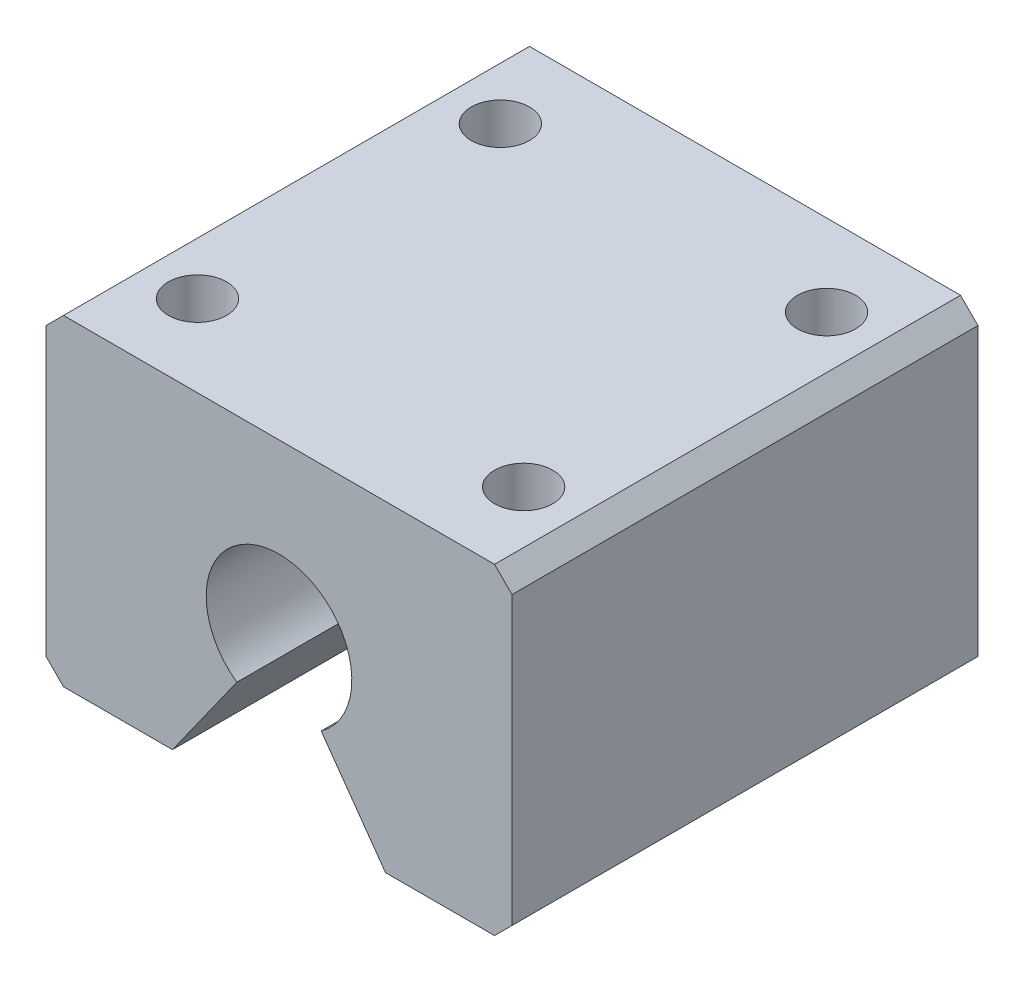
ISO-10303-21;
HEADER;
FILE_DESCRIPTION(('STEP AP214'),'2;1');
FILE_NAME('part.step','',(''),(''),'','','');
FILE_SCHEMA(('AUTOMOTIVE_DESIGN { 1 0 10303 214 1 1 1 1 }'));
ENDSEC;
DATA;
#1=APPLICATION_CONTEXT('core data for automotive mechanical design processes');
#2=APPLICATION_PROTOCOL_DEFINITION('international standard','automotive_design',2000,#1);
#3=PRODUCT_CONTEXT('',#1,'mechanical');
#4=PRODUCT('Part','Part','',(#3));
#5=PRODUCT_RELATED_PRODUCT_CATEGORY('part','',(#4));
#6=PRODUCT_DEFINITION_FORMATION('','',#4);
#7=PRODUCT_DEFINITION_CONTEXT('part definition',#1,'design');
#8=PRODUCT_DEFINITION('design','',#6,#7);
#9=PRODUCT_DEFINITION_SHAPE('','',#8);
#10=(LENGTH_UNIT() NAMED_UNIT(*) SI_UNIT(.MILLI.,.METRE.));
#11=(NAMED_UNIT(*) PLANE_ANGLE_UNIT() SI_UNIT($,.RADIAN.));
#12=(NAMED_UNIT(*) SI_UNIT($,.STERADIAN.) SOLID_ANGLE_UNIT());
#13=UNCERTAINTY_MEASURE_WITH_UNIT(LENGTH_MEASURE(1.E-05),#10,'distance_accuracy_value','');
#14=(GEOMETRIC_REPRESENTATION_CONTEXT(3) GLOBAL_UNCERTAINTY_ASSIGNED_CONTEXT((#13)) GLOBAL_UNIT_ASSIGNED_CONTEXT((#10,
#11,#12)) REPRESENTATION_CONTEXT('',''));
#15=CARTESIAN_POINT('',(0.,0.,0.));
#16=DIRECTION('',(0.,0.,1.));
#17=DIRECTION('',(1.,0.,0.));
#18=AXIS2_PLACEMENT_3D('',#15,#16,#17);
#19=CARTESIAN_POINT('',(0.,0.,0.));
#20=DIRECTION('',(0.,1.,0.));
#21=DIRECTION('',(0.,0.,1.));
#22=AXIS2_PLACEMENT_3D('',#19,#20,#21);
#23=PLANE('',#22);
#24=DIRECTION('',(-1.,0.,0.));
#25=VECTOR('',#24,1.);
#26=CARTESIAN_POINT('',(-20.,0.,-20.));
#27=LINE('',#26,#25);
#28=CARTESIAN_POINT('',(18.5,0.,-20.));
#29=VERTEX_POINT('',#28);
#30=CARTESIAN_POINT('',(9.14121829534251,0.,-20.));
#31=VERTEX_POINT('',#30);
#32=EDGE_CURVE('E196',#29,#31,#27,.T.);
#33=ORIENTED_EDGE('',*,*,#32,.F.);
#34=DIRECTION('',(0.,0.,1.));
#35=VECTOR('',#34,1.);
#36=CARTESIAN_POINT('',(18.5,0.,0.));
#37=LINE('',#36,#35);
#38=CARTESIAN_POINT('',(18.5,0.,20.));
#39=VERTEX_POINT('',#38);
#40=EDGE_CURVE('E234',#29,#39,#37,.T.);
#41=ORIENTED_EDGE('',*,*,#40,.T.);
#42=DIRECTION('',(1.,0.,0.));
#43=VECTOR('',#42,1.);
#44=CARTESIAN_POINT('',(-20.,0.,20.));
#45=LINE('',#44,#43);
#46=CARTESIAN_POINT('',(9.14121829534251,0.,20.));
#47=VERTEX_POINT('',#46);
#48=EDGE_CURVE('E199',#47,#39,#45,.T.);
#49=ORIENTED_EDGE('',*,*,#48,.F.);
#50=DIRECTION('',(0.,0.,1.));
#51=VECTOR('',#50,1.);
#52=CARTESIAN_POINT('',(9.14121829534251,0.,-20.));
#53=LINE('',#52,#51);
#54=EDGE_CURVE('E181',#31,#47,#53,.T.);
#55=ORIENTED_EDGE('',*,*,#54,.F.);
#56=EDGE_LOOP('',(#33,#41,#49,#55));
#57=FACE_BOUND('',#56,.T.);
#58=ADVANCED_FACE('F41',(#57),#23,.F.);
#59=CARTESIAN_POINT('',(20.,27.6,-20.));
#60=DIRECTION('',(-1.,0.,0.));
#61=DIRECTION('',(0.,0.,1.));
#62=AXIS2_PLACEMENT_3D('',#59,#60,#61);
#63=PLANE('',#62);
#64=DIRECTION('',(0.,-1.,0.));
#65=VECTOR('',#64,1.);
#66=CARTESIAN_POINT('',(20.,27.6,20.));
#67=LINE('',#66,#65);
#68=CARTESIAN_POINT('',(20.,26.1,20.));
#69=VERTEX_POINT('',#68);
#70=CARTESIAN_POINT('',(20.,1.50000000000002,20.));
#71=VERTEX_POINT('',#70);
#72=EDGE_CURVE('E195',#69,#71,#67,.T.);
#73=ORIENTED_EDGE('',*,*,#72,.T.);
#74=DIRECTION('',(0.,0.,-1.));
#75=VECTOR('',#74,1.);
#76=CARTESIAN_POINT('',(20.,1.50000000000002,-20.));
#77=LINE('',#76,#75);
#78=CARTESIAN_POINT('',(20.,1.50000000000002,-20.));
#79=VERTEX_POINT('',#78);
#80=EDGE_CURVE('E218',#71,#79,#77,.T.);
#81=ORIENTED_EDGE('',*,*,#80,.T.);
#82=DIRECTION('',(0.,-1.,0.));
#83=VECTOR('',#82,1.);
#84=CARTESIAN_POINT('',(20.,27.6,-20.));
#85=LINE('',#84,#83);
#86=CARTESIAN_POINT('',(20.,26.1,-20.));
#87=VERTEX_POINT('',#86);
#88=EDGE_CURVE('E212',#87,#79,#85,.T.);
#89=ORIENTED_EDGE('',*,*,#88,.F.);
#90=DIRECTION('',(0.,0.,1.));
#91=VECTOR('',#90,1.);
#92=CARTESIAN_POINT('',(20.,26.1,20.));
#93=LINE('',#92,#91);
#94=EDGE_CURVE('E215',#87,#69,#93,.T.);
#95=ORIENTED_EDGE('',*,*,#94,.T.);
#96=EDGE_LOOP('',(#73,#81,#89,#95));
#97=FACE_BOUND('',#96,.T.);
#98=ADVANCED_FACE('F294',(#97),#63,.F.);
#99=CARTESIAN_POINT('',(-20.,27.6,-20.));
#100=DIRECTION('',(0.,0.,1.));
#101=DIRECTION('',(1.,0.,0.));
#102=AXIS2_PLACEMENT_3D('',#99,#100,#101);
#103=PLANE('',#102);
#104=ORIENTED_EDGE('',*,*,#88,.T.);
#105=DIRECTION('',(0.707106781186547,0.707106781186547,0.));
#106=VECTOR('',#105,1.);
#107=CARTESIAN_POINT('',(20.,1.50000000000002,-20.));
#108=LINE('',#107,#106);
#109=EDGE_CURVE('E231',#79,#29,#108,.F.);
#110=ORIENTED_EDGE('',*,*,#109,.T.);
#111=ORIENTED_EDGE('',*,*,#32,.T.);
#112=DIRECTION('',(-0.579153157338015,0.815218756129549,0.));
#113=VECTOR('',#112,1.);
#114=CARTESIAN_POINT('',(9.14121829534251,0.,-20.));
#115=LINE('',#114,#113);
#116=CARTESIAN_POINT('',(3.61970723336259,7.7721053971147,-20.));
#117=VERTEX_POINT('',#116);
#118=EDGE_CURVE('E145',#31,#117,#115,.T.);
#119=ORIENTED_EDGE('',*,*,#118,.T.);
#120=CARTESIAN_POINT('',(0.,12.8672226229244,-20.));
#121=DIRECTION('',(0.,0.,1.));
#122=DIRECTION('',(1.,0.,0.));
#123=AXIS2_PLACEMENT_3D('',#120,#121,#122);
#124=CIRCLE('',#123,6.25);
#125=CARTESIAN_POINT('',(-3.61970723336259,7.7721053971147,-20.));
#126=VERTEX_POINT('',#125);
#127=EDGE_CURVE('E136',#117,#126,#124,.T.);
#128=ORIENTED_EDGE('',*,*,#127,.T.);
#129=DIRECTION('',(-0.579153157338015,-0.815218756129549,0.));
#130=VECTOR('',#129,1.);
#131=CARTESIAN_POINT('',(-9.14121829534251,0.,-20.));
#132=LINE('',#131,#130);
#133=CARTESIAN_POINT('',(-9.14121829534251,0.,-20.));
#134=VERTEX_POINT('',#133);
#135=EDGE_CURVE('E148',#126,#134,#132,.T.);
#136=ORIENTED_EDGE('',*,*,#135,.T.);
#137=CARTESIAN_POINT('',(-18.5,0.,-20.));
#138=VERTEX_POINT('',#137);
#139=EDGE_CURVE('E180',#134,#138,#27,.T.);
#140=ORIENTED_EDGE('',*,*,#139,.T.);
#141=DIRECTION('',(0.707106781186546,-0.707106781186549,0.));
#142=VECTOR('',#141,1.);
#143=CARTESIAN_POINT('',(-20.,1.50000000000002,-20.));
#144=LINE('',#143,#142);
#145=CARTESIAN_POINT('',(-20.,1.50000000000002,-20.));
#146=VERTEX_POINT('',#145);
#147=EDGE_CURVE('E228',#138,#146,#144,.F.);
#148=ORIENTED_EDGE('',*,*,#147,.T.);
#149=DIRECTION('',(0.,-1.,0.));
#150=VECTOR('',#149,1.);
#151=CARTESIAN_POINT('',(-20.,27.6,-20.));
#152=LINE('',#151,#150);
#153=CARTESIAN_POINT('',(-20.,26.1,-20.));
#154=VERTEX_POINT('',#153);
#155=EDGE_CURVE('E208',#154,#146,#152,.T.);
#156=ORIENTED_EDGE('',*,*,#155,.F.);
#157=DIRECTION('',(0.707106781186545,0.70710678118655,0.));
#158=VECTOR('',#157,1.);
#159=CARTESIAN_POINT('',(-18.5,27.6,-20.));
#160=LINE('',#159,#158);
#161=CARTESIAN_POINT('',(-18.5,27.6,-20.));
#162=VERTEX_POINT('',#161);
#163=EDGE_CURVE('E222',#154,#162,#160,.T.);
#164=ORIENTED_EDGE('',*,*,#163,.T.);
#165=DIRECTION('',(-1.,0.,0.));
#166=VECTOR('',#165,1.);
#167=CARTESIAN_POINT('',(-20.,27.6,-20.));
#168=LINE('',#167,#166);
#169=CARTESIAN_POINT('',(18.5,27.6,-20.));
#170=VERTEX_POINT('',#169);
#171=EDGE_CURVE('E186',#170,#162,#168,.T.);
#172=ORIENTED_EDGE('',*,*,#171,.F.);
#173=DIRECTION('',(0.707106781186546,-0.707106781186549,0.));
#174=VECTOR('',#173,1.);
#175=CARTESIAN_POINT('',(18.5,27.6,-20.));
#176=LINE('',#175,#174);
#177=EDGE_CURVE('E225',#170,#87,#176,.T.);
#178=ORIENTED_EDGE('',*,*,#177,.T.);
#179=EDGE_LOOP('',(#104,#110,#111,#119,#128,#136,#140,#148,#156,#164,#172,#178));
#180=FACE_BOUND('',#179,.T.);
#181=ADVANCED_FACE('F157',(#180),#103,.F.);
#182=CARTESIAN_POINT('',(-20.,27.6,-20.));
#183=DIRECTION('',(1.,0.,0.));
#184=DIRECTION('',(0.,0.,-1.));
#185=AXIS2_PLACEMENT_3D('',#182,#183,#184);
#186=PLANE('',#185);
#187=ORIENTED_EDGE('',*,*,#155,.T.);
#188=DIRECTION('',(0.,0.,1.));
#189=VECTOR('',#188,1.);
#190=CARTESIAN_POINT('',(-20.,1.50000000000002,-20.));
#191=LINE('',#190,#189);
#192=CARTESIAN_POINT('',(-20.,1.50000000000002,20.));
#193=VERTEX_POINT('',#192);
#194=EDGE_CURVE('E251',#146,#193,#191,.T.);
#195=ORIENTED_EDGE('',*,*,#194,.T.);
#196=DIRECTION('',(0.,-1.,0.));
#197=VECTOR('',#196,1.);
#198=CARTESIAN_POINT('',(-20.,27.6,20.));
#199=LINE('',#198,#197);
#200=CARTESIAN_POINT('',(-20.,26.1,20.));
#201=VERTEX_POINT('',#200);
#202=EDGE_CURVE('E205',#201,#193,#199,.T.);
#203=ORIENTED_EDGE('',*,*,#202,.F.);
#204=DIRECTION('',(0.,0.,-1.));
#205=VECTOR('',#204,1.);
#206=CARTESIAN_POINT('',(-20.,26.1,-20.));
#207=LINE('',#206,#205);
#208=EDGE_CURVE('E248',#201,#154,#207,.T.);
#209=ORIENTED_EDGE('',*,*,#208,.T.);
#210=EDGE_LOOP('',(#187,#195,#203,#209));
#211=FACE_BOUND('',#210,.T.);
#212=ADVANCED_FACE('F278',(#211),#186,.F.);
#213=CARTESIAN_POINT('',(-20.,27.6,20.));
#214=DIRECTION('',(0.,0.,-1.));
#215=DIRECTION('',(-1.,0.,0.));
#216=AXIS2_PLACEMENT_3D('',#213,#214,#215);
#217=PLANE('',#216);
#218=ORIENTED_EDGE('',*,*,#48,.T.);
#219=DIRECTION('',(-0.707106781186547,-0.707106781186547,0.));
#220=VECTOR('',#219,1.);
#221=CARTESIAN_POINT('',(20.,1.50000000000002,20.));
#222=LINE('',#221,#220);
#223=EDGE_CURVE('E245',#39,#71,#222,.F.);
#224=ORIENTED_EDGE('',*,*,#223,.T.);
#225=ORIENTED_EDGE('',*,*,#72,.F.);
#226=DIRECTION('',(-0.707106781186546,0.707106781186549,0.));
#227=VECTOR('',#226,1.);
#228=CARTESIAN_POINT('',(18.5,27.6,20.));
#229=LINE('',#228,#227);
#230=CARTESIAN_POINT('',(18.5,27.6,20.));
#231=VERTEX_POINT('',#230);
#232=EDGE_CURVE('E240',#69,#231,#229,.T.);
#233=ORIENTED_EDGE('',*,*,#232,.T.);
#234=DIRECTION('',(1.,0.,0.));
#235=VECTOR('',#234,1.);
#236=CARTESIAN_POINT('',(-20.,27.6,20.));
#237=LINE('',#236,#235);
#238=CARTESIAN_POINT('',(-18.5,27.6,20.));
#239=VERTEX_POINT('',#238);
#240=EDGE_CURVE('E190',#239,#231,#237,.T.);
#241=ORIENTED_EDGE('',*,*,#240,.F.);
#242=DIRECTION('',(-0.707106781186545,-0.70710678118655,0.));
#243=VECTOR('',#242,1.);
#244=CARTESIAN_POINT('',(-18.5,27.6,20.));
#245=LINE('',#244,#243);
#246=EDGE_CURVE('E237',#239,#201,#245,.T.);
#247=ORIENTED_EDGE('',*,*,#246,.T.);
#248=ORIENTED_EDGE('',*,*,#202,.T.);
#249=DIRECTION('',(-0.707106781186546,0.707106781186549,0.));
#250=VECTOR('',#249,1.);
#251=CARTESIAN_POINT('',(-20.,1.50000000000002,20.));
#252=LINE('',#251,#250);
#253=CARTESIAN_POINT('',(-18.5,0.,20.));
#254=VERTEX_POINT('',#253);
#255=EDGE_CURVE('E58',#193,#254,#252,.F.);
#256=ORIENTED_EDGE('',*,*,#255,.T.);
#257=CARTESIAN_POINT('',(-9.14121829534251,0.,20.));
#258=VERTEX_POINT('',#257);
#259=EDGE_CURVE('E191',#254,#258,#45,.T.);
#260=ORIENTED_EDGE('',*,*,#259,.T.);
#261=DIRECTION('',(-0.579153157338015,-0.815218756129549,0.));
#262=VECTOR('',#261,1.);
#263=CARTESIAN_POINT('',(-9.14121829534251,0.,20.));
#264=LINE('',#263,#262);
#265=CARTESIAN_POINT('',(-3.61970723336259,7.7721053971147,20.));
#266=VERTEX_POINT('',#265);
#267=EDGE_CURVE('E164',#266,#258,#264,.T.);
#268=ORIENTED_EDGE('',*,*,#267,.F.);
#269=CARTESIAN_POINT('',(0.,12.8672226229244,20.));
#270=DIRECTION('',(0.,0.,1.));
#271=DIRECTION('',(1.,0.,0.));
#272=AXIS2_PLACEMENT_3D('',#269,#270,#271);
#273=CIRCLE('',#272,6.25);
#274=CARTESIAN_POINT('',(3.61970723336259,7.7721053971147,20.));
#275=VERTEX_POINT('',#274);
#276=EDGE_CURVE('E139',#275,#266,#273,.T.);
#277=ORIENTED_EDGE('',*,*,#276,.F.);
#278=DIRECTION('',(-0.579153157338015,0.815218756129549,0.));
#279=VECTOR('',#278,1.);
#280=CARTESIAN_POINT('',(9.14121829534251,0.,20.));
#281=LINE('',#280,#279);
#282=EDGE_CURVE('E160',#47,#275,#281,.T.);
#283=ORIENTED_EDGE('',*,*,#282,.F.);
#284=EDGE_LOOP('',(#218,#224,#225,#233,#241,#247,#248,#256,#260,#268,#277,#283));
#285=FACE_BOUND('',#284,.T.);
#286=ADVANCED_FACE('F267',(#285),#217,.F.);
#287=CARTESIAN_POINT('',(0.,27.6,0.));
#288=DIRECTION('',(0.,1.,0.));
#289=DIRECTION('',(0.,0.,1.));
#290=AXIS2_PLACEMENT_3D('',#287,#288,#289);
#291=PLANE('',#290);
#292=CARTESIAN_POINT('',(-14.,27.6,13.));
#293=DIRECTION('',(0.,1.,0.));
#294=DIRECTION('',(0.,0.,1.));
#295=AXIS2_PLACEMENT_3D('',#292,#293,#294);
#296=CIRCLE('',#295,2.5);
#297=CARTESIAN_POINT('',(-14.,27.6,15.5));
#298=VERTEX_POINT('',#297);
#299=EDGE_CURVE('E528',#298,#298,#296,.T.);
#300=ORIENTED_EDGE('',*,*,#299,.F.);
#301=EDGE_LOOP('',(#300));
#302=FACE_BOUND('',#301,.T.);
#303=CARTESIAN_POINT('',(14.,27.6,13.));
#304=DIRECTION('',(0.,1.,0.));
#305=DIRECTION('',(0.,0.,1.));
#306=AXIS2_PLACEMENT_3D('',#303,#304,#305);
#307=CIRCLE('',#306,2.5);
#308=CARTESIAN_POINT('',(14.,27.6,15.5));
#309=VERTEX_POINT('',#308);
#310=EDGE_CURVE('E520',#309,#309,#307,.T.);
#311=ORIENTED_EDGE('',*,*,#310,.F.);
#312=EDGE_LOOP('',(#311));
#313=FACE_BOUND('',#312,.T.);
#314=CARTESIAN_POINT('',(14.,27.6,-13.));
#315=DIRECTION('',(0.,1.,0.));
#316=DIRECTION('',(0.,0.,1.));
#317=AXIS2_PLACEMENT_3D('',#314,#315,#316);
#318=CIRCLE('',#317,2.5);
#319=CARTESIAN_POINT('',(14.,27.6,-10.5));
#320=VERTEX_POINT('',#319);
#321=EDGE_CURVE('E509',#320,#320,#318,.T.);
#322=ORIENTED_EDGE('',*,*,#321,.F.);
#323=EDGE_LOOP('',(#322));
#324=FACE_BOUND('',#323,.T.);
#325=CARTESIAN_POINT('',(-14.,27.6,-13.));
#326=DIRECTION('',(0.,1.,0.));
#327=DIRECTION('',(0.,0.,1.));
#328=AXIS2_PLACEMENT_3D('',#325,#326,#327);
#329=CIRCLE('',#328,2.5);
#330=CARTESIAN_POINT('',(-14.,27.6,-10.5));
#331=VERTEX_POINT('',#330);
#332=EDGE_CURVE('E167',#331,#331,#329,.T.);
#333=ORIENTED_EDGE('',*,*,#332,.F.);
#334=EDGE_LOOP('',(#333));
#335=FACE_BOUND('',#334,.T.);
#336=ORIENTED_EDGE('',*,*,#240,.T.);
#337=DIRECTION('',(0.,0.,-1.));
#338=VECTOR('',#337,1.);
#339=CARTESIAN_POINT('',(18.5,27.6,-20.));
#340=LINE('',#339,#338);
#341=EDGE_CURVE('E11',#231,#170,#340,.T.);
#342=ORIENTED_EDGE('',*,*,#341,.T.);
#343=ORIENTED_EDGE('',*,*,#171,.T.);
#344=DIRECTION('',(0.,0.,1.));
#345=VECTOR('',#344,1.);
#346=CARTESIAN_POINT('',(-18.5,27.6,20.));
#347=LINE('',#346,#345);
#348=EDGE_CURVE('E51',#162,#239,#347,.T.);
#349=ORIENTED_EDGE('',*,*,#348,.T.);
#350=EDGE_LOOP('',(#336,#342,#343,#349));
#351=FACE_BOUND('',#350,.T.);
#352=ADVANCED_FACE('F261',(#302,#313,#324,#335,#351),#291,.T.);
#353=ORIENTED_EDGE('',*,*,#259,.F.);
#354=DIRECTION('',(0.,0.,-1.));
#355=VECTOR('',#354,1.);
#356=CARTESIAN_POINT('',(-18.5,0.,0.));
#357=LINE('',#356,#355);
#358=EDGE_CURVE('E254',#254,#138,#357,.T.);
#359=ORIENTED_EDGE('',*,*,#358,.T.);
#360=ORIENTED_EDGE('',*,*,#139,.F.);
#361=DIRECTION('',(0.,0.,1.));
#362=VECTOR('',#361,1.);
#363=CARTESIAN_POINT('',(-9.14121829534251,0.,-20.));
#364=LINE('',#363,#362);
#365=EDGE_CURVE('E144',#134,#258,#364,.T.);
#366=ORIENTED_EDGE('',*,*,#365,.T.);
#367=EDGE_LOOP('',(#353,#359,#360,#366));
#368=FACE_BOUND('',#367,.T.);
#369=ADVANCED_FACE('F298',(#368),#23,.F.);
#370=CARTESIAN_POINT('',(0.,12.8672226229244,-20.));
#371=DIRECTION('',(0.,0.,1.));
#372=DIRECTION('',(1.,0.,0.));
#373=AXIS2_PLACEMENT_3D('',#370,#371,#372);
#374=CYLINDRICAL_SURFACE('',#373,6.25);
#375=ORIENTED_EDGE('',*,*,#276,.T.);
#376=DIRECTION('',(0.,0.,1.));
#377=VECTOR('',#376,1.);
#378=CARTESIAN_POINT('',(-3.61970723336259,7.7721053971147,-20.));
#379=LINE('',#378,#377);
#380=EDGE_CURVE('E132',#126,#266,#379,.T.);
#381=ORIENTED_EDGE('',*,*,#380,.F.);
#382=ORIENTED_EDGE('',*,*,#127,.F.);
#383=DIRECTION('',(0.,0.,1.));
#384=VECTOR('',#383,1.);
#385=CARTESIAN_POINT('',(3.61970723336259,7.7721053971147,-20.));
#386=LINE('',#385,#384);
#387=EDGE_CURVE('E177',#117,#275,#386,.T.);
#388=ORIENTED_EDGE('',*,*,#387,.T.);
#389=EDGE_LOOP('',(#375,#381,#382,#388));
#390=FACE_BOUND('',#389,.T.);
#391=ADVANCED_FACE('F134',(#390),#374,.F.);
#392=CARTESIAN_POINT('',(9.14121829534251,0.,-20.));
#393=DIRECTION('',(0.815218756129549,0.579153157338015,0.));
#394=DIRECTION('',(-0.579153157338015,0.815218756129549,0.));
#395=AXIS2_PLACEMENT_3D('',#392,#393,#394);
#396=PLANE('',#395);
#397=ORIENTED_EDGE('',*,*,#282,.T.);
#398=ORIENTED_EDGE('',*,*,#387,.F.);
#399=ORIENTED_EDGE('',*,*,#118,.F.);
#400=ORIENTED_EDGE('',*,*,#54,.T.);
#401=EDGE_LOOP('',(#397,#398,#399,#400));
#402=FACE_BOUND('',#401,.T.);
#403=ADVANCED_FACE('F297',(#402),#396,.F.);
#404=CARTESIAN_POINT('',(-9.14121829534251,0.,-20.));
#405=DIRECTION('',(-0.815218756129549,0.579153157338015,0.));
#406=DIRECTION('',(-0.579153157338015,-0.815218756129549,0.));
#407=AXIS2_PLACEMENT_3D('',#404,#405,#406);
#408=PLANE('',#407);
#409=ORIENTED_EDGE('',*,*,#267,.T.);
#410=ORIENTED_EDGE('',*,*,#365,.F.);
#411=ORIENTED_EDGE('',*,*,#135,.F.);
#412=ORIENTED_EDGE('',*,*,#380,.T.);
#413=EDGE_LOOP('',(#409,#410,#411,#412));
#414=FACE_BOUND('',#413,.T.);
#415=ADVANCED_FACE('F149',(#414),#408,.F.);
#416=CARTESIAN_POINT('',(-14.,13.,-13.));
#417=DIRECTION('',(0.,1.,0.));
#418=DIRECTION('',(0.,0.,1.));
#419=AXIS2_PLACEMENT_3D('',#416,#417,#418);
#420=CYLINDRICAL_SURFACE('',#419,2.5);
#421=CARTESIAN_POINT('',(-14.,13.,-13.));
#422=DIRECTION('',(0.,1.,0.));
#423=DIRECTION('',(0.,0.,1.));
#424=AXIS2_PLACEMENT_3D('',#421,#422,#423);
#425=CIRCLE('',#424,2.5);
#426=CARTESIAN_POINT('',(-14.,13.,-10.5));
#427=VERTEX_POINT('',#426);
#428=EDGE_CURVE('E174',#427,#427,#425,.T.);
#429=ORIENTED_EDGE('',*,*,#428,.F.);
#430=EDGE_LOOP('',(#429));
#431=FACE_BOUND('',#430,.T.);
#432=ORIENTED_EDGE('',*,*,#332,.T.);
#433=EDGE_LOOP('',(#432));
#434=FACE_BOUND('',#433,.T.);
#435=ADVANCED_FACE('F463',(#431,#434),#420,.F.);
#436=CARTESIAN_POINT('',(-14.,13.,-13.));
#437=DIRECTION('',(0.,1.,0.));
#438=DIRECTION('',(0.,0.,1.));
#439=AXIS2_PLACEMENT_3D('',#436,#437,#438);
#440=PLANE('',#439);
#441=ORIENTED_EDGE('',*,*,#428,.T.);
#442=EDGE_LOOP('',(#441));
#443=FACE_BOUND('',#442,.T.);
#444=ADVANCED_FACE('F453',(#443),#440,.T.);
#445=CARTESIAN_POINT('',(14.,13.,-13.));
#446=DIRECTION('',(0.,1.,0.));
#447=DIRECTION('',(0.,0.,1.));
#448=AXIS2_PLACEMENT_3D('',#445,#446,#447);
#449=CYLINDRICAL_SURFACE('',#448,2.5);
#450=CARTESIAN_POINT('',(14.,13.,-13.));
#451=DIRECTION('',(0.,1.,0.));
#452=DIRECTION('',(0.,0.,1.));
#453=AXIS2_PLACEMENT_3D('',#450,#451,#452);
#454=CIRCLE('',#453,2.5);
#455=CARTESIAN_POINT('',(14.,13.,-10.5));
#456=VERTEX_POINT('',#455);
#457=EDGE_CURVE('E505',#456,#456,#454,.T.);
#458=ORIENTED_EDGE('',*,*,#457,.F.);
#459=EDGE_LOOP('',(#458));
#460=FACE_BOUND('',#459,.T.);
#461=ORIENTED_EDGE('',*,*,#321,.T.);
#462=EDGE_LOOP('',(#461));
#463=FACE_BOUND('',#462,.T.);
#464=ADVANCED_FACE('F443',(#460,#463),#449,.F.);
#465=CARTESIAN_POINT('',(14.,13.,-13.));
#466=DIRECTION('',(0.,1.,0.));
#467=DIRECTION('',(0.,0.,1.));
#468=AXIS2_PLACEMENT_3D('',#465,#466,#467);
#469=PLANE('',#468);
#470=ORIENTED_EDGE('',*,*,#457,.T.);
#471=EDGE_LOOP('',(#470));
#472=FACE_BOUND('',#471,.T.);
#473=ADVANCED_FACE('F433',(#472),#469,.T.);
#474=CARTESIAN_POINT('',(14.,13.,13.));
#475=DIRECTION('',(0.,1.,0.));
#476=DIRECTION('',(0.,0.,1.));
#477=AXIS2_PLACEMENT_3D('',#474,#475,#476);
#478=CYLINDRICAL_SURFACE('',#477,2.5);
#479=CARTESIAN_POINT('',(14.,13.,13.));
#480=DIRECTION('',(0.,1.,0.));
#481=DIRECTION('',(0.,0.,1.));
#482=AXIS2_PLACEMENT_3D('',#479,#480,#481);
#483=CIRCLE('',#482,2.5);
#484=CARTESIAN_POINT('',(14.,13.,15.5));
#485=VERTEX_POINT('',#484);
#486=EDGE_CURVE('E514',#485,#485,#483,.T.);
#487=ORIENTED_EDGE('',*,*,#486,.F.);
#488=EDGE_LOOP('',(#487));
#489=FACE_BOUND('',#488,.T.);
#490=ORIENTED_EDGE('',*,*,#310,.T.);
#491=EDGE_LOOP('',(#490));
#492=FACE_BOUND('',#491,.T.);
#493=ADVANCED_FACE('F423',(#489,#492),#478,.F.);
#494=CARTESIAN_POINT('',(14.,13.,13.));
#495=DIRECTION('',(0.,1.,0.));
#496=DIRECTION('',(0.,0.,1.));
#497=AXIS2_PLACEMENT_3D('',#494,#495,#496);
#498=PLANE('',#497);
#499=ORIENTED_EDGE('',*,*,#486,.T.);
#500=EDGE_LOOP('',(#499));
#501=FACE_BOUND('',#500,.T.);
#502=ADVANCED_FACE('F413',(#501),#498,.T.);
#503=CARTESIAN_POINT('',(-14.,13.,13.));
#504=DIRECTION('',(0.,1.,0.));
#505=DIRECTION('',(0.,0.,1.));
#506=AXIS2_PLACEMENT_3D('',#503,#504,#505);
#507=CYLINDRICAL_SURFACE('',#506,2.5);
#508=CARTESIAN_POINT('',(-14.,13.,13.));
#509=DIRECTION('',(0.,1.,0.));
#510=DIRECTION('',(0.,0.,1.));
#511=AXIS2_PLACEMENT_3D('',#508,#509,#510);
#512=CIRCLE('',#511,2.5);
#513=CARTESIAN_POINT('',(-14.,13.,15.5));
#514=VERTEX_POINT('',#513);
#515=EDGE_CURVE('E524',#514,#514,#512,.T.);
#516=ORIENTED_EDGE('',*,*,#515,.F.);
#517=EDGE_LOOP('',(#516));
#518=FACE_BOUND('',#517,.T.);
#519=ORIENTED_EDGE('',*,*,#299,.T.);
#520=EDGE_LOOP('',(#519));
#521=FACE_BOUND('',#520,.T.);
#522=ADVANCED_FACE('F403',(#518,#521),#507,.F.);
#523=CARTESIAN_POINT('',(-14.,13.,13.));
#524=DIRECTION('',(0.,1.,0.));
#525=DIRECTION('',(0.,0.,1.));
#526=AXIS2_PLACEMENT_3D('',#523,#524,#525);
#527=PLANE('',#526);
#528=ORIENTED_EDGE('',*,*,#515,.T.);
#529=EDGE_LOOP('',(#528));
#530=FACE_BOUND('',#529,.T.);
#531=ADVANCED_FACE('F326',(#530),#527,.T.);
#532=CARTESIAN_POINT('',(20.,1.50000000000002,-20.));
#533=DIRECTION('',(-0.707106781186547,0.707106781186547,0.));
#534=DIRECTION('',(0.,0.,-1.));
#535=AXIS2_PLACEMENT_3D('',#532,#533,#534);
#536=PLANE('',#535);
#537=ORIENTED_EDGE('',*,*,#223,.F.);
#538=ORIENTED_EDGE('',*,*,#40,.F.);
#539=ORIENTED_EDGE('',*,*,#109,.F.);
#540=ORIENTED_EDGE('',*,*,#80,.F.);
#541=EDGE_LOOP('',(#537,#538,#539,#540));
#542=FACE_BOUND('',#541,.T.);
#543=ADVANCED_FACE('F292',(#542),#536,.F.);
#544=CARTESIAN_POINT('',(-20.,1.50000000000002,-20.));
#545=DIRECTION('',(0.707106781186549,0.707106781186546,0.));
#546=DIRECTION('',(0.,0.,1.));
#547=AXIS2_PLACEMENT_3D('',#544,#545,#546);
#548=PLANE('',#547);
#549=ORIENTED_EDGE('',*,*,#147,.F.);
#550=ORIENTED_EDGE('',*,*,#358,.F.);
#551=ORIENTED_EDGE('',*,*,#255,.F.);
#552=ORIENTED_EDGE('',*,*,#194,.F.);
#553=EDGE_LOOP('',(#549,#550,#551,#552));
#554=FACE_BOUND('',#553,.T.);
#555=ADVANCED_FACE('F280',(#554),#548,.F.);
#556=CARTESIAN_POINT('',(18.5,27.6,0.));
#557=DIRECTION('',(0.707106781186549,0.707106781186546,0.));
#558=DIRECTION('',(0.,0.,1.));
#559=AXIS2_PLACEMENT_3D('',#556,#557,#558);
#560=PLANE('',#559);
#561=ORIENTED_EDGE('',*,*,#232,.F.);
#562=ORIENTED_EDGE('',*,*,#94,.F.);
#563=ORIENTED_EDGE('',*,*,#177,.F.);
#564=ORIENTED_EDGE('',*,*,#341,.F.);
#565=EDGE_LOOP('',(#561,#562,#563,#564));
#566=FACE_BOUND('',#565,.T.);
#567=ADVANCED_FACE('F273',(#566),#560,.T.);
#568=CARTESIAN_POINT('',(-18.5,27.6,0.));
#569=DIRECTION('',(-0.70710678118655,0.707106781186545,0.));
#570=DIRECTION('',(0.,0.,-1.));
#571=AXIS2_PLACEMENT_3D('',#568,#569,#570);
#572=PLANE('',#571);
#573=ORIENTED_EDGE('',*,*,#163,.F.);
#574=ORIENTED_EDGE('',*,*,#208,.F.);
#575=ORIENTED_EDGE('',*,*,#246,.F.);
#576=ORIENTED_EDGE('',*,*,#348,.F.);
#577=EDGE_LOOP('',(#573,#574,#575,#576));
#578=FACE_BOUND('',#577,.T.);
#579=ADVANCED_FACE('F44',(#578),#572,.T.);
#580=CLOSED_SHELL('',(#58,#98,#181,#212,#286,#352,#369,#391,#403,#415,#435,#444,#464,#473,#493,
#502,#522,#531,#543,#555,#567,#579));
#581=MANIFOLD_SOLID_BREP('B2',#580);
#582=ADVANCED_BREP_SHAPE_REPRESENTATION('',(#18,#581),#14);
#583=SHAPE_DEFINITION_REPRESENTATION(#9,#582);
ENDSEC;
END-ISO-10303-21;
